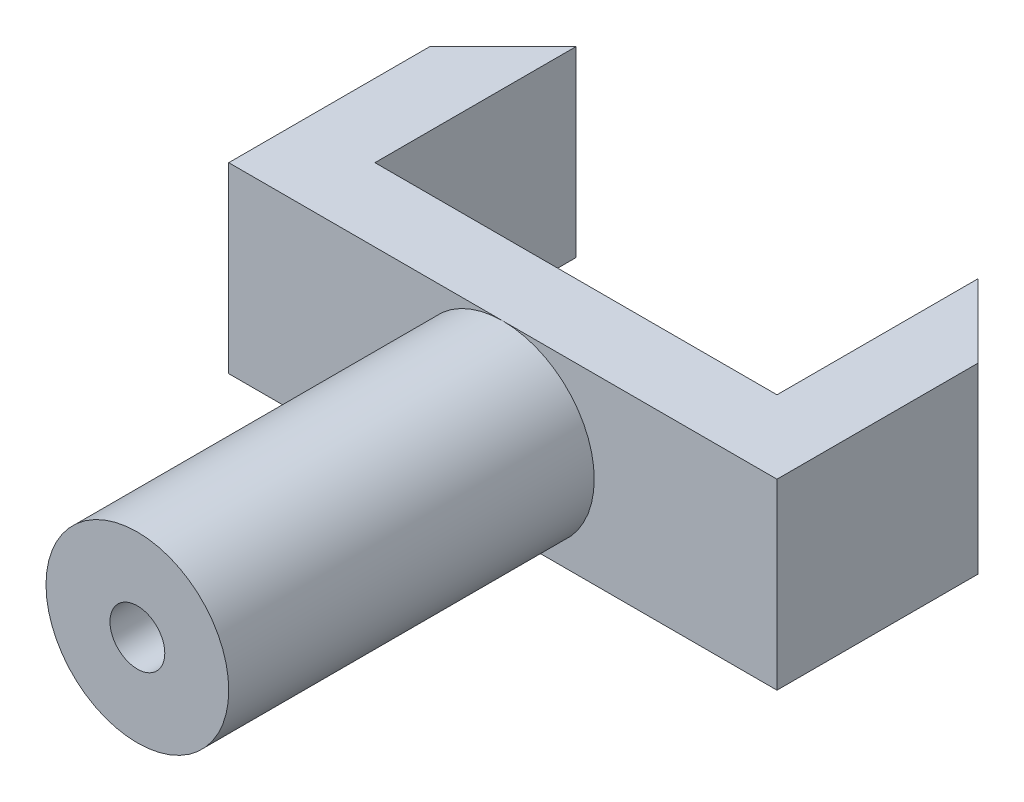
ISO-10303-21;
HEADER;
FILE_DESCRIPTION(('STEP AP214'),'2;1');
FILE_NAME('part.step','',(''),(''),'','','');
FILE_SCHEMA(('AUTOMOTIVE_DESIGN { 1 0 10303 214 1 1 1 1 }'));
ENDSEC;
DATA;
#1=APPLICATION_CONTEXT('core data for automotive mechanical design processes');
#2=APPLICATION_PROTOCOL_DEFINITION('international standard','automotive_design',2000,#1);
#3=PRODUCT_CONTEXT('',#1,'mechanical');
#4=PRODUCT('Part','Part','',(#3));
#5=PRODUCT_RELATED_PRODUCT_CATEGORY('part','',(#4));
#6=PRODUCT_DEFINITION_FORMATION('','',#4);
#7=PRODUCT_DEFINITION_CONTEXT('part definition',#1,'design');
#8=PRODUCT_DEFINITION('design','',#6,#7);
#9=PRODUCT_DEFINITION_SHAPE('','',#8);
#10=(LENGTH_UNIT() NAMED_UNIT(*) SI_UNIT(.MILLI.,.METRE.));
#11=(NAMED_UNIT(*) PLANE_ANGLE_UNIT() SI_UNIT($,.RADIAN.));
#12=(NAMED_UNIT(*) SI_UNIT($,.STERADIAN.) SOLID_ANGLE_UNIT());
#13=UNCERTAINTY_MEASURE_WITH_UNIT(LENGTH_MEASURE(1.E-05),#10,'distance_accuracy_value','');
#14=(GEOMETRIC_REPRESENTATION_CONTEXT(3) GLOBAL_UNCERTAINTY_ASSIGNED_CONTEXT((#13)) GLOBAL_UNIT_ASSIGNED_CONTEXT((#10,
#11,#12)) REPRESENTATION_CONTEXT('',''));
#15=CARTESIAN_POINT('',(0.,0.,0.));
#16=DIRECTION('',(0.,0.,1.));
#17=DIRECTION('',(1.,0.,0.));
#18=AXIS2_PLACEMENT_3D('',#15,#16,#17);
#19=CARTESIAN_POINT('',(0.,0.,-40.));
#20=DIRECTION('',(0.,0.,1.));
#21=DIRECTION('',(1.,0.,0.));
#22=AXIS2_PLACEMENT_3D('',#19,#20,#21);
#23=PLANE('',#22);
#24=DIRECTION('',(0.,1.,0.));
#25=VECTOR('',#24,1.);
#26=CARTESIAN_POINT('',(110.,50.,-40.));
#27=LINE('',#26,#25);
#28=CARTESIAN_POINT('',(110.,-50.,-40.));
#29=VERTEX_POINT('',#28);
#30=CARTESIAN_POINT('',(110.,50.,-40.));
#31=VERTEX_POINT('',#30);
#32=EDGE_CURVE('E115',#29,#31,#27,.T.);
#33=ORIENTED_EDGE('',*,*,#32,.F.);
#34=DIRECTION('',(-1.,0.,0.));
#35=VECTOR('',#34,1.);
#36=CARTESIAN_POINT('',(150.,-50.,-40.));
#37=LINE('',#36,#35);
#38=CARTESIAN_POINT('',(-110.,-50.,-40.));
#39=VERTEX_POINT('',#38);
#40=EDGE_CURVE('E122',#29,#39,#37,.T.);
#41=ORIENTED_EDGE('',*,*,#40,.T.);
#42=DIRECTION('',(0.,-1.,0.));
#43=VECTOR('',#42,1.);
#44=CARTESIAN_POINT('',(-110.,33.8231152643986,-40.));
#45=LINE('',#44,#43);
#46=CARTESIAN_POINT('',(-110.,50.,-40.));
#47=VERTEX_POINT('',#46);
#48=EDGE_CURVE('E118',#47,#39,#45,.T.);
#49=ORIENTED_EDGE('',*,*,#48,.F.);
#50=DIRECTION('',(1.,0.,0.));
#51=VECTOR('',#50,1.);
#52=CARTESIAN_POINT('',(150.,50.,-40.));
#53=LINE('',#52,#51);
#54=EDGE_CURVE('E131',#47,#31,#53,.T.);
#55=ORIENTED_EDGE('',*,*,#54,.T.);
#56=EDGE_LOOP('',(#33,#41,#49,#55));
#57=FACE_BOUND('',#56,.T.);
#58=ADVANCED_FACE('F39',(#57),#23,.F.);
#59=CARTESIAN_POINT('',(0.,0.,200.));
#60=DIRECTION('',(0.,0.,1.));
#61=DIRECTION('',(1.,0.,0.));
#62=AXIS2_PLACEMENT_3D('',#59,#60,#61);
#63=PLANE('',#62);
#64=CARTESIAN_POINT('',(0.,0.,200.));
#65=DIRECTION('',(0.,0.,1.));
#66=DIRECTION('',(1.,0.,0.));
#67=AXIS2_PLACEMENT_3D('',#64,#65,#66);
#68=CIRCLE('',#67,50.);
#69=CARTESIAN_POINT('',(50.,0.,200.));
#70=VERTEX_POINT('',#69);
#71=EDGE_CURVE('E186',#70,#70,#68,.T.);
#72=ORIENTED_EDGE('',*,*,#71,.T.);
#73=EDGE_LOOP('',(#72));
#74=FACE_BOUND('',#73,.T.);
#75=CARTESIAN_POINT('',(0.,0.,200.));
#76=DIRECTION('',(0.,0.,1.));
#77=DIRECTION('',(1.,0.,0.));
#78=AXIS2_PLACEMENT_3D('',#75,#76,#77);
#79=CIRCLE('',#78,15.);
#80=CARTESIAN_POINT('',(15.,0.,200.));
#81=VERTEX_POINT('',#80);
#82=EDGE_CURVE('E178',#81,#81,#79,.T.);
#83=ORIENTED_EDGE('',*,*,#82,.F.);
#84=EDGE_LOOP('',(#83));
#85=FACE_BOUND('',#84,.T.);
#86=ADVANCED_FACE('F252',(#74,#85),#63,.T.);
#87=CARTESIAN_POINT('',(0.,0.,200.));
#88=DIRECTION('',(0.,0.,-1.));
#89=DIRECTION('',(-1.,0.,0.));
#90=AXIS2_PLACEMENT_3D('',#87,#88,#89);
#91=CYLINDRICAL_SURFACE('',#90,50.);
#92=ORIENTED_EDGE('',*,*,#71,.F.);
#93=EDGE_LOOP('',(#92));
#94=FACE_BOUND('',#93,.T.);
#95=CARTESIAN_POINT('',(0.,0.,0.));
#96=DIRECTION('',(0.,0.,1.));
#97=DIRECTION('',(1.,0.,0.));
#98=AXIS2_PLACEMENT_3D('',#95,#96,#97);
#99=CIRCLE('',#98,50.);
#100=CARTESIAN_POINT('',(0.,50.,0.));
#101=VERTEX_POINT('',#100);
#102=CARTESIAN_POINT('',(0.,-50.,0.));
#103=VERTEX_POINT('',#102);
#104=EDGE_CURVE('E191',#101,#103,#99,.T.);
#105=ORIENTED_EDGE('',*,*,#104,.T.);
#106=EDGE_CURVE('E182',#103,#101,#99,.T.);
#107=ORIENTED_EDGE('',*,*,#106,.T.);
#108=EDGE_LOOP('',(#105,#107));
#109=FACE_BOUND('',#108,.T.);
#110=ADVANCED_FACE('F231',(#94,#109),#91,.T.);
#111=CARTESIAN_POINT('',(0.,0.,200.));
#112=DIRECTION('',(0.,0.,-1.));
#113=DIRECTION('',(-1.,0.,0.));
#114=AXIS2_PLACEMENT_3D('',#111,#112,#113);
#115=CYLINDRICAL_SURFACE('',#114,15.);
#116=ORIENTED_EDGE('',*,*,#82,.T.);
#117=EDGE_LOOP('',(#116));
#118=FACE_BOUND('',#117,.T.);
#119=CARTESIAN_POINT('',(0.,0.,0.));
#120=DIRECTION('',(0.,0.,1.));
#121=DIRECTION('',(1.,0.,0.));
#122=AXIS2_PLACEMENT_3D('',#119,#120,#121);
#123=CIRCLE('',#122,15.);
#124=CARTESIAN_POINT('',(15.,0.,0.));
#125=VERTEX_POINT('',#124);
#126=EDGE_CURVE('E177',#125,#125,#123,.T.);
#127=ORIENTED_EDGE('',*,*,#126,.F.);
#128=EDGE_LOOP('',(#127));
#129=FACE_BOUND('',#128,.T.);
#130=ADVANCED_FACE('F265',(#118,#129),#115,.F.);
#131=CARTESIAN_POINT('',(0.,0.,0.));
#132=DIRECTION('',(0.,0.,1.));
#133=DIRECTION('',(1.,0.,0.));
#134=AXIS2_PLACEMENT_3D('',#131,#132,#133);
#135=PLANE('',#134);
#136=ORIENTED_EDGE('',*,*,#126,.T.);
#137=EDGE_LOOP('',(#136));
#138=FACE_BOUND('',#137,.T.);
#139=ADVANCED_FACE('F262',(#138),#135,.T.);
#140=ORIENTED_EDGE('',*,*,#104,.F.);
#141=DIRECTION('',(1.,0.,0.));
#142=VECTOR('',#141,1.);
#143=CARTESIAN_POINT('',(150.,50.,0.));
#144=LINE('',#143,#142);
#145=CARTESIAN_POINT('',(-150.,50.,0.));
#146=VERTEX_POINT('',#145);
#147=EDGE_CURVE('E151',#146,#101,#144,.T.);
#148=ORIENTED_EDGE('',*,*,#147,.F.);
#149=DIRECTION('',(0.,1.,0.));
#150=VECTOR('',#149,1.);
#151=CARTESIAN_POINT('',(-150.,50.,0.));
#152=LINE('',#151,#150);
#153=CARTESIAN_POINT('',(-150.,-50.,0.));
#154=VERTEX_POINT('',#153);
#155=EDGE_CURVE('E149',#154,#146,#152,.T.);
#156=ORIENTED_EDGE('',*,*,#155,.F.);
#157=DIRECTION('',(-1.,0.,0.));
#158=VECTOR('',#157,1.);
#159=CARTESIAN_POINT('',(150.,-50.,0.));
#160=LINE('',#159,#158);
#161=EDGE_CURVE('E158',#103,#154,#160,.T.);
#162=ORIENTED_EDGE('',*,*,#161,.F.);
#163=EDGE_LOOP('',(#140,#148,#156,#162));
#164=FACE_BOUND('',#163,.T.);
#165=ADVANCED_FACE('F233',(#164),#135,.T.);
#166=ORIENTED_EDGE('',*,*,#106,.F.);
#167=CARTESIAN_POINT('',(150.,-50.,0.));
#168=VERTEX_POINT('',#167);
#169=EDGE_CURVE('E159',#168,#103,#160,.T.);
#170=ORIENTED_EDGE('',*,*,#169,.F.);
#171=DIRECTION('',(0.,-1.,0.));
#172=VECTOR('',#171,1.);
#173=CARTESIAN_POINT('',(150.,33.4358855903544,0.));
#174=LINE('',#173,#172);
#175=CARTESIAN_POINT('',(150.,50.,0.));
#176=VERTEX_POINT('',#175);
#177=EDGE_CURVE('E154',#176,#168,#174,.T.);
#178=ORIENTED_EDGE('',*,*,#177,.F.);
#179=EDGE_CURVE('E147',#101,#176,#144,.T.);
#180=ORIENTED_EDGE('',*,*,#179,.F.);
#181=EDGE_LOOP('',(#166,#170,#178,#180));
#182=FACE_BOUND('',#181,.T.);
#183=ADVANCED_FACE('F224',(#182),#135,.T.);
#184=CARTESIAN_POINT('',(150.,50.,-40.));
#185=DIRECTION('',(0.,-1.,0.));
#186=DIRECTION('',(0.,0.,-1.));
#187=AXIS2_PLACEMENT_3D('',#184,#185,#186);
#188=PLANE('',#187);
#189=DIRECTION('',(0.,0.,1.));
#190=VECTOR('',#189,1.);
#191=CARTESIAN_POINT('',(150.,50.,-40.));
#192=LINE('',#191,#190);
#193=CARTESIAN_POINT('',(150.,50.,-110.));
#194=VERTEX_POINT('',#193);
#195=EDGE_CURVE('E174',#194,#176,#192,.T.);
#196=ORIENTED_EDGE('',*,*,#195,.F.);
#197=DIRECTION('',(-0.707106781186551,0.,-0.707106781186544));
#198=VECTOR('',#197,1.);
#199=CARTESIAN_POINT('',(99.9999999999991,50.,-160.));
#200=LINE('',#199,#198);
#201=CARTESIAN_POINT('',(110.,50.,-149.999999999999));
#202=VERTEX_POINT('',#201);
#203=EDGE_CURVE('E11',#194,#202,#200,.T.);
#204=ORIENTED_EDGE('',*,*,#203,.T.);
#205=DIRECTION('',(0.,0.,1.));
#206=VECTOR('',#205,1.);
#207=CARTESIAN_POINT('',(110.,50.,-160.));
#208=LINE('',#207,#206);
#209=EDGE_CURVE('E119',#202,#31,#208,.T.);
#210=ORIENTED_EDGE('',*,*,#209,.T.);
#211=ORIENTED_EDGE('',*,*,#54,.F.);
#212=DIRECTION('',(0.,0.,1.));
#213=VECTOR('',#212,1.);
#214=CARTESIAN_POINT('',(-110.,50.,-160.));
#215=LINE('',#214,#213);
#216=CARTESIAN_POINT('',(-110.,50.,-149.999999999999));
#217=VERTEX_POINT('',#216);
#218=EDGE_CURVE('E144',#217,#47,#215,.T.);
#219=ORIENTED_EDGE('',*,*,#218,.F.);
#220=DIRECTION('',(0.707106781186551,0.,-0.707106781186544));
#221=VECTOR('',#220,1.);
#222=CARTESIAN_POINT('',(-99.9999999999991,50.,-160.));
#223=LINE('',#222,#221);
#224=CARTESIAN_POINT('',(-150.,50.,-110.));
#225=VERTEX_POINT('',#224);
#226=EDGE_CURVE('E197',#217,#225,#223,.F.);
#227=ORIENTED_EDGE('',*,*,#226,.T.);
#228=DIRECTION('',(0.,0.,1.));
#229=VECTOR('',#228,1.);
#230=CARTESIAN_POINT('',(-150.,50.,-40.));
#231=LINE('',#230,#229);
#232=EDGE_CURVE('E130',#225,#146,#231,.T.);
#233=ORIENTED_EDGE('',*,*,#232,.T.);
#234=ORIENTED_EDGE('',*,*,#147,.T.);
#235=ORIENTED_EDGE('',*,*,#179,.T.);
#236=EDGE_LOOP('',(#196,#204,#210,#211,#219,#227,#233,#234,#235));
#237=FACE_BOUND('',#236,.T.);
#238=ADVANCED_FACE('F216',(#237),#188,.F.);
#239=CARTESIAN_POINT('',(150.,33.4358855903544,-40.));
#240=DIRECTION('',(-1.,0.,0.));
#241=DIRECTION('',(0.,0.,1.));
#242=AXIS2_PLACEMENT_3D('',#239,#240,#241);
#243=PLANE('',#242);
#244=DIRECTION('',(0.,0.,1.));
#245=VECTOR('',#244,1.);
#246=CARTESIAN_POINT('',(150.,-50.,-40.));
#247=LINE('',#246,#245);
#248=CARTESIAN_POINT('',(150.,-50.,-110.));
#249=VERTEX_POINT('',#248);
#250=EDGE_CURVE('E171',#249,#168,#247,.T.);
#251=ORIENTED_EDGE('',*,*,#250,.F.);
#252=DIRECTION('',(0.,1.,0.));
#253=VECTOR('',#252,1.);
#254=CARTESIAN_POINT('',(150.,50.,-110.));
#255=LINE('',#254,#253);
#256=EDGE_CURVE('E48',#249,#194,#255,.T.);
#257=ORIENTED_EDGE('',*,*,#256,.T.);
#258=ORIENTED_EDGE('',*,*,#195,.T.);
#259=ORIENTED_EDGE('',*,*,#177,.T.);
#260=EDGE_LOOP('',(#251,#257,#258,#259));
#261=FACE_BOUND('',#260,.T.);
#262=ADVANCED_FACE('F213',(#261),#243,.F.);
#263=CARTESIAN_POINT('',(150.,-50.,-40.));
#264=DIRECTION('',(0.,1.,0.));
#265=DIRECTION('',(-1.,0.,0.));
#266=AXIS2_PLACEMENT_3D('',#263,#264,#265);
#267=PLANE('',#266);
#268=DIRECTION('',(0.,0.,1.));
#269=VECTOR('',#268,1.);
#270=CARTESIAN_POINT('',(110.,-50.,-160.));
#271=LINE('',#270,#269);
#272=CARTESIAN_POINT('',(110.,-50.,-149.999999999999));
#273=VERTEX_POINT('',#272);
#274=EDGE_CURVE('E110',#273,#29,#271,.T.);
#275=ORIENTED_EDGE('',*,*,#274,.F.);
#276=DIRECTION('',(0.707106781186551,0.,0.707106781186544));
#277=VECTOR('',#276,1.);
#278=CARTESIAN_POINT('',(99.9999999999991,-50.,-160.));
#279=LINE('',#278,#277);
#280=EDGE_CURVE('E61',#273,#249,#279,.T.);
#281=ORIENTED_EDGE('',*,*,#280,.T.);
#282=ORIENTED_EDGE('',*,*,#250,.T.);
#283=ORIENTED_EDGE('',*,*,#169,.T.);
#284=ORIENTED_EDGE('',*,*,#161,.T.);
#285=DIRECTION('',(0.,0.,1.));
#286=VECTOR('',#285,1.);
#287=CARTESIAN_POINT('',(-150.,-50.,-40.));
#288=LINE('',#287,#286);
#289=CARTESIAN_POINT('',(-150.,-50.,-110.));
#290=VERTEX_POINT('',#289);
#291=EDGE_CURVE('E168',#290,#154,#288,.T.);
#292=ORIENTED_EDGE('',*,*,#291,.F.);
#293=DIRECTION('',(-0.707106781186551,0.,0.707106781186544));
#294=VECTOR('',#293,1.);
#295=CARTESIAN_POINT('',(-99.9999999999991,-50.,-160.));
#296=LINE('',#295,#294);
#297=CARTESIAN_POINT('',(-110.,-50.,-149.999999999999));
#298=VERTEX_POINT('',#297);
#299=EDGE_CURVE('E204',#290,#298,#296,.F.);
#300=ORIENTED_EDGE('',*,*,#299,.T.);
#301=DIRECTION('',(0.,0.,1.));
#302=VECTOR('',#301,1.);
#303=CARTESIAN_POINT('',(-110.,-50.,-160.));
#304=LINE('',#303,#302);
#305=EDGE_CURVE('E125',#298,#39,#304,.T.);
#306=ORIENTED_EDGE('',*,*,#305,.T.);
#307=ORIENTED_EDGE('',*,*,#40,.F.);
#308=EDGE_LOOP('',(#275,#281,#282,#283,#284,#292,#300,#306,#307));
#309=FACE_BOUND('',#308,.T.);
#310=ADVANCED_FACE('F123',(#309),#267,.F.);
#311=CARTESIAN_POINT('',(-150.,50.,-40.));
#312=DIRECTION('',(1.,0.,0.));
#313=DIRECTION('',(0.,0.,-1.));
#314=AXIS2_PLACEMENT_3D('',#311,#312,#313);
#315=PLANE('',#314);
#316=ORIENTED_EDGE('',*,*,#232,.F.);
#317=DIRECTION('',(0.,-1.,0.));
#318=VECTOR('',#317,1.);
#319=CARTESIAN_POINT('',(-150.,50.,-110.));
#320=LINE('',#319,#318);
#321=EDGE_CURVE('E200',#225,#290,#320,.T.);
#322=ORIENTED_EDGE('',*,*,#321,.T.);
#323=ORIENTED_EDGE('',*,*,#291,.T.);
#324=ORIENTED_EDGE('',*,*,#155,.T.);
#325=EDGE_LOOP('',(#316,#322,#323,#324));
#326=FACE_BOUND('',#325,.T.);
#327=ADVANCED_FACE('F238',(#326),#315,.F.);
#328=CARTESIAN_POINT('',(-110.,33.8231152643986,-160.));
#329=DIRECTION('',(-1.,0.,0.));
#330=DIRECTION('',(0.,-1.,0.));
#331=AXIS2_PLACEMENT_3D('',#328,#329,#330);
#332=PLANE('',#331);
#333=ORIENTED_EDGE('',*,*,#305,.F.);
#334=DIRECTION('',(0.,-1.,0.));
#335=VECTOR('',#334,1.);
#336=CARTESIAN_POINT('',(-110.,0.,-149.999999999999));
#337=LINE('',#336,#335);
#338=EDGE_CURVE('E190',#298,#217,#337,.F.);
#339=ORIENTED_EDGE('',*,*,#338,.T.);
#340=ORIENTED_EDGE('',*,*,#218,.T.);
#341=ORIENTED_EDGE('',*,*,#48,.T.);
#342=EDGE_LOOP('',(#333,#339,#340,#341));
#343=FACE_BOUND('',#342,.T.);
#344=ADVANCED_FACE('F243',(#343),#332,.F.);
#345=CARTESIAN_POINT('',(110.,50.,-160.));
#346=DIRECTION('',(1.,0.,0.));
#347=DIRECTION('',(0.,1.,0.));
#348=AXIS2_PLACEMENT_3D('',#345,#346,#347);
#349=PLANE('',#348);
#350=ORIENTED_EDGE('',*,*,#209,.F.);
#351=DIRECTION('',(0.,-1.,0.));
#352=VECTOR('',#351,1.);
#353=CARTESIAN_POINT('',(110.,0.,-149.999999999999));
#354=LINE('',#353,#352);
#355=EDGE_CURVE('E116',#202,#273,#354,.T.);
#356=ORIENTED_EDGE('',*,*,#355,.T.);
#357=ORIENTED_EDGE('',*,*,#274,.T.);
#358=ORIENTED_EDGE('',*,*,#32,.T.);
#359=EDGE_LOOP('',(#350,#356,#357,#358));
#360=FACE_BOUND('',#359,.T.);
#361=ADVANCED_FACE('F113',(#360),#349,.F.);
#362=CARTESIAN_POINT('',(-99.9999999999991,0.,-160.));
#363=DIRECTION('',(0.707106781186544,0.,0.707106781186551));
#364=DIRECTION('',(0.,1.,0.));
#365=AXIS2_PLACEMENT_3D('',#362,#363,#364);
#366=PLANE('',#365);
#367=ORIENTED_EDGE('',*,*,#299,.F.);
#368=ORIENTED_EDGE('',*,*,#321,.F.);
#369=ORIENTED_EDGE('',*,*,#226,.F.);
#370=ORIENTED_EDGE('',*,*,#338,.F.);
#371=EDGE_LOOP('',(#367,#368,#369,#370));
#372=FACE_BOUND('',#371,.T.);
#373=ADVANCED_FACE('F246',(#372),#366,.F.);
#374=CARTESIAN_POINT('',(99.9999999999991,0.,-160.));
#375=DIRECTION('',(0.707106781186544,0.,-0.707106781186551));
#376=DIRECTION('',(0.,1.,0.));
#377=AXIS2_PLACEMENT_3D('',#374,#375,#376);
#378=PLANE('',#377);
#379=ORIENTED_EDGE('',*,*,#203,.F.);
#380=ORIENTED_EDGE('',*,*,#256,.F.);
#381=ORIENTED_EDGE('',*,*,#280,.F.);
#382=ORIENTED_EDGE('',*,*,#355,.F.);
#383=EDGE_LOOP('',(#379,#380,#381,#382));
#384=FACE_BOUND('',#383,.T.);
#385=ADVANCED_FACE('F41',(#384),#378,.T.);
#386=CLOSED_SHELL('',(#58,#86,#110,#130,#139,#165,#183,#238,#262,#310,#327,#344,#361,#373,#385));
#387=MANIFOLD_SOLID_BREP('B2',#386);
#388=ADVANCED_BREP_SHAPE_REPRESENTATION('',(#18,#387),#14);
#389=SHAPE_DEFINITION_REPRESENTATION(#9,#388);
ENDSEC;
END-ISO-10303-21;
